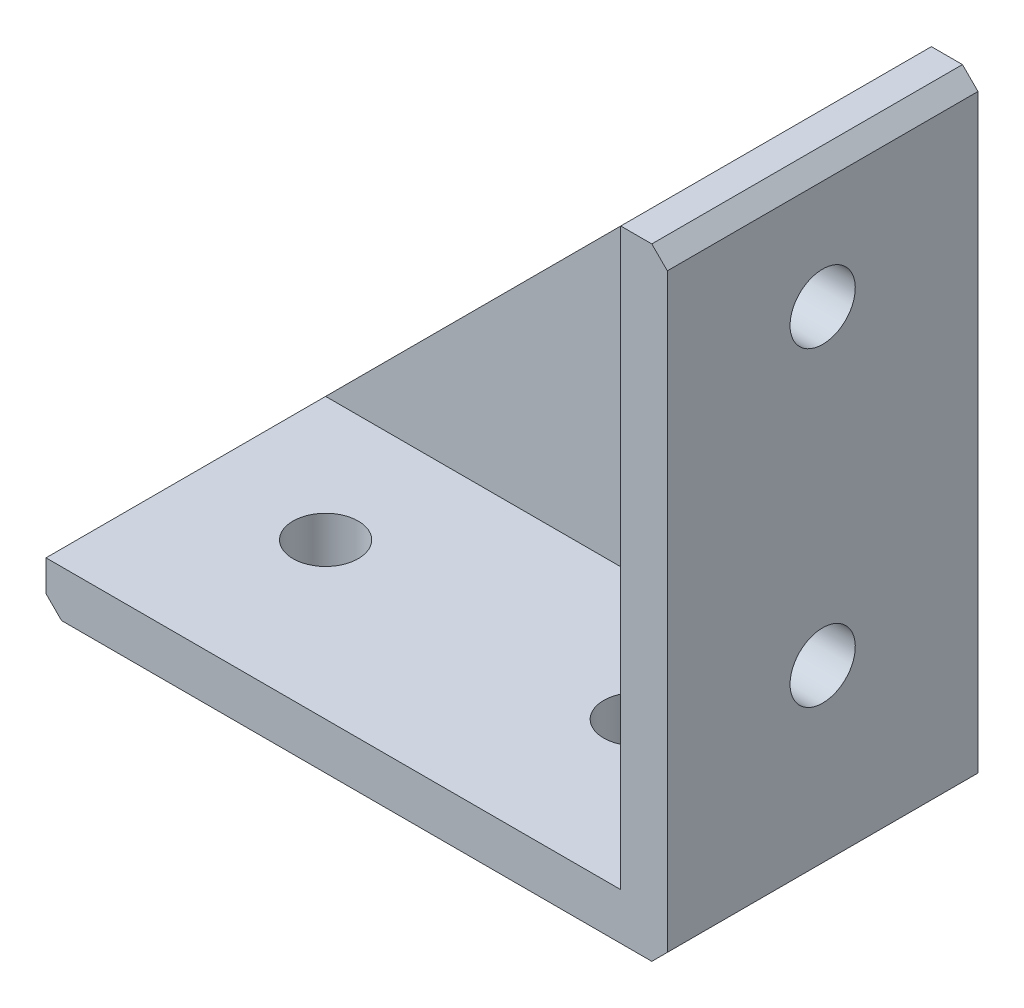
ISO-10303-21;
HEADER;
FILE_DESCRIPTION(('STEP AP214'),'2;1');
FILE_NAME('part.step','',(''),(''),'','','');
FILE_SCHEMA(('AUTOMOTIVE_DESIGN { 1 0 10303 214 1 1 1 1 }'));
ENDSEC;
DATA;
#1=APPLICATION_CONTEXT('core data for automotive mechanical design processes');
#2=APPLICATION_PROTOCOL_DEFINITION('international standard','automotive_design',2000,#1);
#3=PRODUCT_CONTEXT('',#1,'mechanical');
#4=PRODUCT('Part','Part','',(#3));
#5=PRODUCT_RELATED_PRODUCT_CATEGORY('part','',(#4));
#6=PRODUCT_DEFINITION_FORMATION('','',#4);
#7=PRODUCT_DEFINITION_CONTEXT('part definition',#1,'design');
#8=PRODUCT_DEFINITION('design','',#6,#7);
#9=PRODUCT_DEFINITION_SHAPE('','',#8);
#10=(LENGTH_UNIT() NAMED_UNIT(*) SI_UNIT(.MILLI.,.METRE.));
#11=(NAMED_UNIT(*) PLANE_ANGLE_UNIT() SI_UNIT($,.RADIAN.));
#12=(NAMED_UNIT(*) SI_UNIT($,.STERADIAN.) SOLID_ANGLE_UNIT());
#13=UNCERTAINTY_MEASURE_WITH_UNIT(LENGTH_MEASURE(1.E-05),#10,'distance_accuracy_value','');
#14=(GEOMETRIC_REPRESENTATION_CONTEXT(3) GLOBAL_UNCERTAINTY_ASSIGNED_CONTEXT((#13)) GLOBAL_UNIT_ASSIGNED_CONTEXT((#10,
#11,#12)) REPRESENTATION_CONTEXT('',''));
#15=CARTESIAN_POINT('',(0.,0.,0.));
#16=DIRECTION('',(0.,0.,1.));
#17=DIRECTION('',(1.,0.,0.));
#18=AXIS2_PLACEMENT_3D('',#15,#16,#17);
#19=CARTESIAN_POINT('',(0.,0.,20.));
#20=DIRECTION('',(-1.,0.,0.));
#21=DIRECTION('',(0.,0.,1.));
#22=AXIS2_PLACEMENT_3D('',#19,#20,#21);
#23=PLANE('',#22);
#24=CARTESIAN_POINT('',(0.,32.,10.));
#25=DIRECTION('',(-1.,0.,0.));
#26=DIRECTION('',(0.,-1.,0.));
#27=AXIS2_PLACEMENT_3D('',#24,#25,#26);
#28=CIRCLE('',#27,2.1);
#29=CARTESIAN_POINT('',(0.,29.9,10.));
#30=VERTEX_POINT('',#29);
#31=EDGE_CURVE('E232',#30,#30,#28,.T.);
#32=ORIENTED_EDGE('',*,*,#31,.T.);
#33=EDGE_LOOP('',(#32));
#34=FACE_BOUND('',#33,.T.);
#35=CARTESIAN_POINT('',(0.,12.,10.));
#36=DIRECTION('',(-1.,0.,0.));
#37=DIRECTION('',(0.,-1.,0.));
#38=AXIS2_PLACEMENT_3D('',#35,#36,#37);
#39=CIRCLE('',#38,2.1);
#40=CARTESIAN_POINT('',(0.,9.89999999999999,10.));
#41=VERTEX_POINT('',#40);
#42=EDGE_CURVE('E226',#41,#41,#39,.T.);
#43=ORIENTED_EDGE('',*,*,#42,.T.);
#44=EDGE_LOOP('',(#43));
#45=FACE_BOUND('',#44,.T.);
#46=DIRECTION('',(0.,1.,0.));
#47=VECTOR('',#46,1.);
#48=CARTESIAN_POINT('',(0.,0.,20.));
#49=LINE('',#48,#47);
#50=CARTESIAN_POINT('',(0.,0.999999999999994,20.));
#51=VERTEX_POINT('',#50);
#52=CARTESIAN_POINT('',(0.,39.,20.));
#53=VERTEX_POINT('',#52);
#54=EDGE_CURVE('E137',#51,#53,#49,.T.);
#55=ORIENTED_EDGE('',*,*,#54,.F.);
#56=DIRECTION('',(0.,0.,-1.));
#57=VECTOR('',#56,1.);
#58=CARTESIAN_POINT('',(0.,0.999999999999994,20.));
#59=LINE('',#58,#57);
#60=CARTESIAN_POINT('',(0.,0.999999999999994,0.));
#61=VERTEX_POINT('',#60);
#62=EDGE_CURVE('E145',#51,#61,#59,.T.);
#63=ORIENTED_EDGE('',*,*,#62,.T.);
#64=DIRECTION('',(0.,1.,0.));
#65=VECTOR('',#64,1.);
#66=CARTESIAN_POINT('',(0.,0.,0.));
#67=LINE('',#66,#65);
#68=CARTESIAN_POINT('',(0.,39.,0.));
#69=VERTEX_POINT('',#68);
#70=EDGE_CURVE('E139',#61,#69,#67,.T.);
#71=ORIENTED_EDGE('',*,*,#70,.T.);
#72=DIRECTION('',(0.,0.,1.));
#73=VECTOR('',#72,1.);
#74=CARTESIAN_POINT('',(0.,39.,20.));
#75=LINE('',#74,#73);
#76=EDGE_CURVE('E143',#69,#53,#75,.T.);
#77=ORIENTED_EDGE('',*,*,#76,.T.);
#78=EDGE_LOOP('',(#55,#63,#71,#77));
#79=FACE_BOUND('',#78,.T.);
#80=ADVANCED_FACE('F33',(#34,#45,#79),#23,.F.);
#81=CARTESIAN_POINT('',(0.,40.,20.));
#82=DIRECTION('',(0.,-1.,0.));
#83=DIRECTION('',(1.,0.,0.));
#84=AXIS2_PLACEMENT_3D('',#81,#82,#83);
#85=PLANE('',#84);
#86=DIRECTION('',(-1.,0.,0.));
#87=VECTOR('',#86,1.);
#88=CARTESIAN_POINT('',(0.,40.,20.));
#89=LINE('',#88,#87);
#90=CARTESIAN_POINT('',(-1.00000000000001,40.,20.));
#91=VERTEX_POINT('',#90);
#92=CARTESIAN_POINT('',(-3.,40.,20.));
#93=VERTEX_POINT('',#92);
#94=EDGE_CURVE('E174',#91,#93,#89,.T.);
#95=ORIENTED_EDGE('',*,*,#94,.F.);
#96=DIRECTION('',(0.,0.,-1.));
#97=VECTOR('',#96,1.);
#98=CARTESIAN_POINT('',(-1.,40.,20.));
#99=LINE('',#98,#97);
#100=CARTESIAN_POINT('',(-1.,40.,0.));
#101=VERTEX_POINT('',#100);
#102=EDGE_CURVE('E11',#91,#101,#99,.T.);
#103=ORIENTED_EDGE('',*,*,#102,.T.);
#104=DIRECTION('',(-1.,0.,0.));
#105=VECTOR('',#104,1.);
#106=CARTESIAN_POINT('',(0.,40.,0.));
#107=LINE('',#106,#105);
#108=CARTESIAN_POINT('',(-3.,40.,0.));
#109=VERTEX_POINT('',#108);
#110=EDGE_CURVE('E134',#101,#109,#107,.T.);
#111=ORIENTED_EDGE('',*,*,#110,.T.);
#112=DIRECTION('',(0.,0.,1.));
#113=VECTOR('',#112,1.);
#114=CARTESIAN_POINT('',(-3.,40.,0.));
#115=LINE('',#114,#113);
#116=CARTESIAN_POINT('',(-3.,40.,2.));
#117=VERTEX_POINT('',#116);
#118=EDGE_CURVE('E118',#109,#117,#115,.T.);
#119=ORIENTED_EDGE('',*,*,#118,.T.);
#120=DIRECTION('',(0.,0.,1.));
#121=VECTOR('',#120,1.);
#122=CARTESIAN_POINT('',(-3.,40.,2.));
#123=LINE('',#122,#121);
#124=EDGE_CURVE('E191',#117,#93,#123,.T.);
#125=ORIENTED_EDGE('',*,*,#124,.T.);
#126=EDGE_LOOP('',(#95,#103,#111,#119,#125));
#127=FACE_BOUND('',#126,.T.);
#128=ADVANCED_FACE('F258',(#127),#85,.F.);
#129=CARTESIAN_POINT('',(-40.,0.,20.));
#130=DIRECTION('',(1.,0.,0.));
#131=DIRECTION('',(0.,0.,-1.));
#132=AXIS2_PLACEMENT_3D('',#129,#130,#131);
#133=PLANE('',#132);
#134=DIRECTION('',(0.,-1.,0.));
#135=VECTOR('',#134,1.);
#136=CARTESIAN_POINT('',(-40.,0.,0.));
#137=LINE('',#136,#135);
#138=CARTESIAN_POINT('',(-40.,3.,0.));
#139=VERTEX_POINT('',#138);
#140=CARTESIAN_POINT('',(-40.,1.,0.));
#141=VERTEX_POINT('',#140);
#142=EDGE_CURVE('E126',#139,#141,#137,.T.);
#143=ORIENTED_EDGE('',*,*,#142,.T.);
#144=DIRECTION('',(0.,0.,1.));
#145=VECTOR('',#144,1.);
#146=CARTESIAN_POINT('',(-40.,1.,20.));
#147=LINE('',#146,#145);
#148=CARTESIAN_POINT('',(-40.,1.,20.));
#149=VERTEX_POINT('',#148);
#150=EDGE_CURVE('E41',#141,#149,#147,.T.);
#151=ORIENTED_EDGE('',*,*,#150,.T.);
#152=DIRECTION('',(0.,-1.,0.));
#153=VECTOR('',#152,1.);
#154=CARTESIAN_POINT('',(-40.,0.,20.));
#155=LINE('',#154,#153);
#156=CARTESIAN_POINT('',(-40.,3.,20.));
#157=VERTEX_POINT('',#156);
#158=EDGE_CURVE('E184',#157,#149,#155,.T.);
#159=ORIENTED_EDGE('',*,*,#158,.F.);
#160=DIRECTION('',(0.,0.,1.));
#161=VECTOR('',#160,1.);
#162=CARTESIAN_POINT('',(-40.,3.,2.));
#163=LINE('',#162,#161);
#164=CARTESIAN_POINT('',(-40.,3.,2.));
#165=VERTEX_POINT('',#164);
#166=EDGE_CURVE('E127',#165,#157,#163,.T.);
#167=ORIENTED_EDGE('',*,*,#166,.F.);
#168=DIRECTION('',(0.,0.,1.));
#169=VECTOR('',#168,1.);
#170=CARTESIAN_POINT('',(-40.,3.,0.));
#171=LINE('',#170,#169);
#172=EDGE_CURVE('E115',#139,#165,#171,.T.);
#173=ORIENTED_EDGE('',*,*,#172,.F.);
#174=EDGE_LOOP('',(#143,#151,#159,#167,#173));
#175=FACE_BOUND('',#174,.T.);
#176=ADVANCED_FACE('F125',(#175),#133,.F.);
#177=CARTESIAN_POINT('',(0.,0.,20.));
#178=DIRECTION('',(0.,1.,0.));
#179=DIRECTION('',(-1.,0.,0.));
#180=AXIS2_PLACEMENT_3D('',#177,#178,#179);
#181=PLANE('',#180);
#182=CARTESIAN_POINT('',(-32.,0.,10.));
#183=DIRECTION('',(0.,1.,0.));
#184=DIRECTION('',(-1.,0.,0.));
#185=AXIS2_PLACEMENT_3D('',#182,#183,#184);
#186=CIRCLE('',#185,2.1);
#187=CARTESIAN_POINT('',(-34.1,0.,10.));
#188=VERTEX_POINT('',#187);
#189=EDGE_CURVE('E220',#188,#188,#186,.T.);
#190=ORIENTED_EDGE('',*,*,#189,.T.);
#191=EDGE_LOOP('',(#190));
#192=FACE_BOUND('',#191,.T.);
#193=CARTESIAN_POINT('',(-12.,0.,10.));
#194=DIRECTION('',(0.,1.,0.));
#195=DIRECTION('',(-1.,0.,0.));
#196=AXIS2_PLACEMENT_3D('',#193,#194,#195);
#197=CIRCLE('',#196,2.1);
#198=CARTESIAN_POINT('',(-14.1,0.,10.));
#199=VERTEX_POINT('',#198);
#200=EDGE_CURVE('E215',#199,#199,#197,.T.);
#201=ORIENTED_EDGE('',*,*,#200,.T.);
#202=EDGE_LOOP('',(#201));
#203=FACE_BOUND('',#202,.T.);
#204=DIRECTION('',(1.,0.,0.));
#205=VECTOR('',#204,1.);
#206=CARTESIAN_POINT('',(0.,0.,0.));
#207=LINE('',#206,#205);
#208=CARTESIAN_POINT('',(-39.,0.,0.));
#209=VERTEX_POINT('',#208);
#210=CARTESIAN_POINT('',(-1.,0.,0.));
#211=VERTEX_POINT('',#210);
#212=EDGE_CURVE('E133',#209,#211,#207,.T.);
#213=ORIENTED_EDGE('',*,*,#212,.T.);
#214=DIRECTION('',(0.,0.,1.));
#215=VECTOR('',#214,1.);
#216=CARTESIAN_POINT('',(-1.,0.,20.));
#217=LINE('',#216,#215);
#218=CARTESIAN_POINT('',(-1.,0.,20.));
#219=VERTEX_POINT('',#218);
#220=EDGE_CURVE('E157',#211,#219,#217,.T.);
#221=ORIENTED_EDGE('',*,*,#220,.T.);
#222=DIRECTION('',(1.,0.,0.));
#223=VECTOR('',#222,1.);
#224=CARTESIAN_POINT('',(0.,0.,20.));
#225=LINE('',#224,#223);
#226=CARTESIAN_POINT('',(-39.,0.,20.));
#227=VERTEX_POINT('',#226);
#228=EDGE_CURVE('E146',#227,#219,#225,.T.);
#229=ORIENTED_EDGE('',*,*,#228,.F.);
#230=DIRECTION('',(0.,0.,-1.));
#231=VECTOR('',#230,1.);
#232=CARTESIAN_POINT('',(-39.,0.,20.));
#233=LINE('',#232,#231);
#234=EDGE_CURVE('E154',#227,#209,#233,.T.);
#235=ORIENTED_EDGE('',*,*,#234,.T.);
#236=EDGE_LOOP('',(#213,#221,#229,#235));
#237=FACE_BOUND('',#236,.T.);
#238=ADVANCED_FACE('F178',(#192,#203,#237),#181,.F.);
#239=CARTESIAN_POINT('',(0.,0.,20.));
#240=DIRECTION('',(0.,0.,1.));
#241=DIRECTION('',(1.,0.,0.));
#242=AXIS2_PLACEMENT_3D('',#239,#240,#241);
#243=PLANE('',#242);
#244=ORIENTED_EDGE('',*,*,#228,.T.);
#245=DIRECTION('',(-0.70710678118655,-0.707106781186545,0.));
#246=VECTOR('',#245,1.);
#247=CARTESIAN_POINT('',(-0.499999999999997,0.5,20.));
#248=LINE('',#247,#246);
#249=EDGE_CURVE('E162',#219,#51,#248,.F.);
#250=ORIENTED_EDGE('',*,*,#249,.T.);
#251=ORIENTED_EDGE('',*,*,#54,.T.);
#252=DIRECTION('',(0.707106781186545,-0.70710678118655,0.));
#253=VECTOR('',#252,1.);
#254=CARTESIAN_POINT('',(19.5,19.4999999999999,20.));
#255=LINE('',#254,#253);
#256=EDGE_CURVE('E48',#53,#91,#255,.F.);
#257=ORIENTED_EDGE('',*,*,#256,.T.);
#258=ORIENTED_EDGE('',*,*,#94,.T.);
#259=DIRECTION('',(0.,1.,0.));
#260=VECTOR('',#259,1.);
#261=CARTESIAN_POINT('',(-3.,40.,20.));
#262=LINE('',#261,#260);
#263=CARTESIAN_POINT('',(-3.,3.,20.));
#264=VERTEX_POINT('',#263);
#265=EDGE_CURVE('E199',#264,#93,#262,.T.);
#266=ORIENTED_EDGE('',*,*,#265,.F.);
#267=DIRECTION('',(1.,0.,0.));
#268=VECTOR('',#267,1.);
#269=CARTESIAN_POINT('',(-40.,3.,20.));
#270=LINE('',#269,#268);
#271=EDGE_CURVE('E187',#157,#264,#270,.T.);
#272=ORIENTED_EDGE('',*,*,#271,.F.);
#273=ORIENTED_EDGE('',*,*,#158,.T.);
#274=DIRECTION('',(-0.707106781186543,0.707106781186552,0.));
#275=VECTOR('',#274,1.);
#276=CARTESIAN_POINT('',(-19.5000000000003,-19.5,20.));
#277=LINE('',#276,#275);
#278=EDGE_CURVE('E160',#149,#227,#277,.F.);
#279=ORIENTED_EDGE('',*,*,#278,.T.);
#280=EDGE_LOOP('',(#244,#250,#251,#257,#258,#266,#272,#273,#279));
#281=FACE_BOUND('',#280,.T.);
#282=ADVANCED_FACE('F166',(#281),#243,.T.);
#283=CARTESIAN_POINT('',(0.,0.,0.));
#284=DIRECTION('',(0.,0.,1.));
#285=DIRECTION('',(1.,0.,0.));
#286=AXIS2_PLACEMENT_3D('',#283,#284,#285);
#287=PLANE('',#286);
#288=ORIENTED_EDGE('',*,*,#70,.F.);
#289=DIRECTION('',(0.70710678118655,0.707106781186545,0.));
#290=VECTOR('',#289,1.);
#291=CARTESIAN_POINT('',(0.,0.999999999999994,0.));
#292=LINE('',#291,#290);
#293=EDGE_CURVE('E152',#61,#211,#292,.F.);
#294=ORIENTED_EDGE('',*,*,#293,.T.);
#295=ORIENTED_EDGE('',*,*,#212,.F.);
#296=DIRECTION('',(0.707106781186543,-0.707106781186552,0.));
#297=VECTOR('',#296,1.);
#298=CARTESIAN_POINT('',(-39.,0.,0.));
#299=LINE('',#298,#297);
#300=EDGE_CURVE('E132',#209,#141,#299,.F.);
#301=ORIENTED_EDGE('',*,*,#300,.T.);
#302=ORIENTED_EDGE('',*,*,#142,.F.);
#303=DIRECTION('',(0.707106781186548,0.707106781186548,0.));
#304=VECTOR('',#303,1.);
#305=CARTESIAN_POINT('',(-40.,3.,0.));
#306=LINE('',#305,#304);
#307=EDGE_CURVE('E112',#139,#109,#306,.T.);
#308=ORIENTED_EDGE('',*,*,#307,.T.);
#309=ORIENTED_EDGE('',*,*,#110,.F.);
#310=DIRECTION('',(-0.707106781186545,0.70710678118655,0.));
#311=VECTOR('',#310,1.);
#312=CARTESIAN_POINT('',(-1.,40.,0.));
#313=LINE('',#312,#311);
#314=EDGE_CURVE('E149',#101,#69,#313,.F.);
#315=ORIENTED_EDGE('',*,*,#314,.T.);
#316=EDGE_LOOP('',(#288,#294,#295,#301,#302,#308,#309,#315));
#317=FACE_BOUND('',#316,.T.);
#318=ADVANCED_FACE('F130',(#317),#287,.F.);
#319=CARTESIAN_POINT('',(-3.,40.,2.));
#320=DIRECTION('',(1.,0.,0.));
#321=DIRECTION('',(0.,1.,0.));
#322=AXIS2_PLACEMENT_3D('',#319,#320,#321);
#323=PLANE('',#322);
#324=CARTESIAN_POINT('',(-3.,32.,10.));
#325=DIRECTION('',(-1.,0.,0.));
#326=DIRECTION('',(0.,-1.,0.));
#327=AXIS2_PLACEMENT_3D('',#324,#325,#326);
#328=CIRCLE('',#327,2.1);
#329=CARTESIAN_POINT('',(-3.,29.9,10.));
#330=VERTEX_POINT('',#329);
#331=EDGE_CURVE('E235',#330,#330,#328,.T.);
#332=ORIENTED_EDGE('',*,*,#331,.F.);
#333=EDGE_LOOP('',(#332));
#334=FACE_BOUND('',#333,.T.);
#335=CARTESIAN_POINT('',(-3.,12.,10.));
#336=DIRECTION('',(-1.,0.,0.));
#337=DIRECTION('',(0.,-1.,0.));
#338=AXIS2_PLACEMENT_3D('',#335,#336,#337);
#339=CIRCLE('',#338,2.1);
#340=CARTESIAN_POINT('',(-3.,9.89999999999999,10.));
#341=VERTEX_POINT('',#340);
#342=EDGE_CURVE('E229',#341,#341,#339,.T.);
#343=ORIENTED_EDGE('',*,*,#342,.F.);
#344=EDGE_LOOP('',(#343));
#345=FACE_BOUND('',#344,.T.);
#346=ORIENTED_EDGE('',*,*,#265,.T.);
#347=ORIENTED_EDGE('',*,*,#124,.F.);
#348=DIRECTION('',(0.,1.,0.));
#349=VECTOR('',#348,1.);
#350=CARTESIAN_POINT('',(-3.,40.,2.));
#351=LINE('',#350,#349);
#352=CARTESIAN_POINT('',(-3.,3.,2.));
#353=VERTEX_POINT('',#352);
#354=EDGE_CURVE('E202',#353,#117,#351,.T.);
#355=ORIENTED_EDGE('',*,*,#354,.F.);
#356=DIRECTION('',(0.,0.,1.));
#357=VECTOR('',#356,1.);
#358=CARTESIAN_POINT('',(-3.,3.,2.));
#359=LINE('',#358,#357);
#360=EDGE_CURVE('E193',#353,#264,#359,.T.);
#361=ORIENTED_EDGE('',*,*,#360,.T.);
#362=EDGE_LOOP('',(#346,#347,#355,#361));
#363=FACE_BOUND('',#362,.T.);
#364=ADVANCED_FACE('F250',(#334,#345,#363),#323,.F.);
#365=CARTESIAN_POINT('',(-40.,3.,2.));
#366=DIRECTION('',(0.,-1.,0.));
#367=DIRECTION('',(1.,0.,0.));
#368=AXIS2_PLACEMENT_3D('',#365,#366,#367);
#369=PLANE('',#368);
#370=CARTESIAN_POINT('',(-32.,3.,10.));
#371=DIRECTION('',(0.,1.,0.));
#372=DIRECTION('',(-1.,0.,0.));
#373=AXIS2_PLACEMENT_3D('',#370,#371,#372);
#374=CIRCLE('',#373,2.1);
#375=CARTESIAN_POINT('',(-34.1,3.,10.));
#376=VERTEX_POINT('',#375);
#377=EDGE_CURVE('E223',#376,#376,#374,.T.);
#378=ORIENTED_EDGE('',*,*,#377,.F.);
#379=EDGE_LOOP('',(#378));
#380=FACE_BOUND('',#379,.T.);
#381=CARTESIAN_POINT('',(-12.,3.,10.));
#382=DIRECTION('',(0.,1.,0.));
#383=DIRECTION('',(-1.,0.,0.));
#384=AXIS2_PLACEMENT_3D('',#381,#382,#383);
#385=CIRCLE('',#384,2.1);
#386=CARTESIAN_POINT('',(-14.1,3.,10.));
#387=VERTEX_POINT('',#386);
#388=EDGE_CURVE('E217',#387,#387,#385,.T.);
#389=ORIENTED_EDGE('',*,*,#388,.F.);
#390=EDGE_LOOP('',(#389));
#391=FACE_BOUND('',#390,.T.);
#392=ORIENTED_EDGE('',*,*,#271,.T.);
#393=ORIENTED_EDGE('',*,*,#360,.F.);
#394=DIRECTION('',(1.,0.,0.));
#395=VECTOR('',#394,1.);
#396=CARTESIAN_POINT('',(-40.,3.,2.));
#397=LINE('',#396,#395);
#398=EDGE_CURVE('E206',#165,#353,#397,.T.);
#399=ORIENTED_EDGE('',*,*,#398,.F.);
#400=ORIENTED_EDGE('',*,*,#166,.T.);
#401=EDGE_LOOP('',(#392,#393,#399,#400));
#402=FACE_BOUND('',#401,.T.);
#403=ADVANCED_FACE('F253',(#380,#391,#402),#369,.F.);
#404=CARTESIAN_POINT('',(0.,0.,2.));
#405=DIRECTION('',(0.,0.,1.));
#406=DIRECTION('',(1.,0.,0.));
#407=AXIS2_PLACEMENT_3D('',#404,#405,#406);
#408=PLANE('',#407);
#409=DIRECTION('',(0.707106781186548,0.707106781186548,0.));
#410=VECTOR('',#409,1.);
#411=CARTESIAN_POINT('',(-40.,3.,2.));
#412=LINE('',#411,#410);
#413=EDGE_CURVE('E122',#165,#117,#412,.T.);
#414=ORIENTED_EDGE('',*,*,#413,.F.);
#415=ORIENTED_EDGE('',*,*,#398,.T.);
#416=ORIENTED_EDGE('',*,*,#354,.T.);
#417=EDGE_LOOP('',(#414,#415,#416));
#418=FACE_BOUND('',#417,.T.);
#419=ADVANCED_FACE('F281',(#418),#408,.T.);
#420=CARTESIAN_POINT('',(-40.,3.,0.));
#421=DIRECTION('',(0.707106781186548,-0.707106781186548,0.));
#422=DIRECTION('',(0.707106781186547,0.707106781186548,0.));
#423=AXIS2_PLACEMENT_3D('',#420,#421,#422);
#424=PLANE('',#423);
#425=ORIENTED_EDGE('',*,*,#413,.T.);
#426=ORIENTED_EDGE('',*,*,#118,.F.);
#427=ORIENTED_EDGE('',*,*,#307,.F.);
#428=ORIENTED_EDGE('',*,*,#172,.T.);
#429=EDGE_LOOP('',(#425,#426,#427,#428));
#430=FACE_BOUND('',#429,.T.);
#431=ADVANCED_FACE('F114',(#430),#424,.F.);
#432=CARTESIAN_POINT('',(0.,0.999999999999994,20.));
#433=DIRECTION('',(-0.707106781186545,0.70710678118655,0.));
#434=DIRECTION('',(0.,0.,-1.));
#435=AXIS2_PLACEMENT_3D('',#432,#433,#434);
#436=PLANE('',#435);
#437=ORIENTED_EDGE('',*,*,#249,.F.);
#438=ORIENTED_EDGE('',*,*,#220,.F.);
#439=ORIENTED_EDGE('',*,*,#293,.F.);
#440=ORIENTED_EDGE('',*,*,#62,.F.);
#441=EDGE_LOOP('',(#437,#438,#439,#440));
#442=FACE_BOUND('',#441,.T.);
#443=ADVANCED_FACE('F176',(#442),#436,.F.);
#444=CARTESIAN_POINT('',(-39.,0.,20.));
#445=DIRECTION('',(0.707106781186552,0.707106781186543,0.));
#446=DIRECTION('',(0.,0.,-1.));
#447=AXIS2_PLACEMENT_3D('',#444,#445,#446);
#448=PLANE('',#447);
#449=ORIENTED_EDGE('',*,*,#278,.F.);
#450=ORIENTED_EDGE('',*,*,#150,.F.);
#451=ORIENTED_EDGE('',*,*,#300,.F.);
#452=ORIENTED_EDGE('',*,*,#234,.F.);
#453=EDGE_LOOP('',(#449,#450,#451,#452));
#454=FACE_BOUND('',#453,.T.);
#455=ADVANCED_FACE('F182',(#454),#448,.F.);
#456=CARTESIAN_POINT('',(-1.,40.,20.));
#457=DIRECTION('',(-0.70710678118655,-0.707106781186545,0.));
#458=DIRECTION('',(0.,0.,-1.));
#459=AXIS2_PLACEMENT_3D('',#456,#457,#458);
#460=PLANE('',#459);
#461=ORIENTED_EDGE('',*,*,#256,.F.);
#462=ORIENTED_EDGE('',*,*,#76,.F.);
#463=ORIENTED_EDGE('',*,*,#314,.F.);
#464=ORIENTED_EDGE('',*,*,#102,.F.);
#465=EDGE_LOOP('',(#461,#462,#463,#464));
#466=FACE_BOUND('',#465,.T.);
#467=ADVANCED_FACE('F35',(#466),#460,.F.);
#468=CARTESIAN_POINT('',(-12.,0.,10.));
#469=DIRECTION('',(0.,1.,0.));
#470=DIRECTION('',(-1.,0.,0.));
#471=AXIS2_PLACEMENT_3D('',#468,#469,#470);
#472=CYLINDRICAL_SURFACE('',#471,2.1);
#473=ORIENTED_EDGE('',*,*,#200,.F.);
#474=EDGE_LOOP('',(#473));
#475=FACE_BOUND('',#474,.T.);
#476=ORIENTED_EDGE('',*,*,#388,.T.);
#477=EDGE_LOOP('',(#476));
#478=FACE_BOUND('',#477,.T.);
#479=ADVANCED_FACE('F261',(#475,#478),#472,.F.);
#480=CARTESIAN_POINT('',(-32.,0.,10.));
#481=DIRECTION('',(0.,1.,0.));
#482=DIRECTION('',(-1.,0.,0.));
#483=AXIS2_PLACEMENT_3D('',#480,#481,#482);
#484=CYLINDRICAL_SURFACE('',#483,2.1);
#485=ORIENTED_EDGE('',*,*,#189,.F.);
#486=EDGE_LOOP('',(#485));
#487=FACE_BOUND('',#486,.T.);
#488=ORIENTED_EDGE('',*,*,#377,.T.);
#489=EDGE_LOOP('',(#488));
#490=FACE_BOUND('',#489,.T.);
#491=ADVANCED_FACE('F266',(#487,#490),#484,.F.);
#492=CARTESIAN_POINT('',(0.,12.,10.));
#493=DIRECTION('',(-1.,0.,0.));
#494=DIRECTION('',(0.,-1.,0.));
#495=AXIS2_PLACEMENT_3D('',#492,#493,#494);
#496=CYLINDRICAL_SURFACE('',#495,2.1);
#497=ORIENTED_EDGE('',*,*,#42,.F.);
#498=EDGE_LOOP('',(#497));
#499=FACE_BOUND('',#498,.T.);
#500=ORIENTED_EDGE('',*,*,#342,.T.);
#501=EDGE_LOOP('',(#500));
#502=FACE_BOUND('',#501,.T.);
#503=ADVANCED_FACE('F246',(#499,#502),#496,.F.);
#504=CARTESIAN_POINT('',(0.,32.,10.));
#505=DIRECTION('',(-1.,0.,0.));
#506=DIRECTION('',(0.,-1.,0.));
#507=AXIS2_PLACEMENT_3D('',#504,#505,#506);
#508=CYLINDRICAL_SURFACE('',#507,2.1);
#509=ORIENTED_EDGE('',*,*,#31,.F.);
#510=EDGE_LOOP('',(#509));
#511=FACE_BOUND('',#510,.T.);
#512=ORIENTED_EDGE('',*,*,#331,.T.);
#513=EDGE_LOOP('',(#512));
#514=FACE_BOUND('',#513,.T.);
#515=ADVANCED_FACE('F243',(#511,#514),#508,.F.);
#516=CLOSED_SHELL('',(#80,#128,#176,#238,#282,#318,#364,#403,#419,#431,#443,#455,#467,#479,#491,
#503,#515));
#517=MANIFOLD_SOLID_BREP('B2',#516);
#518=ADVANCED_BREP_SHAPE_REPRESENTATION('',(#18,#517),#14);
#519=SHAPE_DEFINITION_REPRESENTATION(#9,#518);
ENDSEC;
END-ISO-10303-21;
